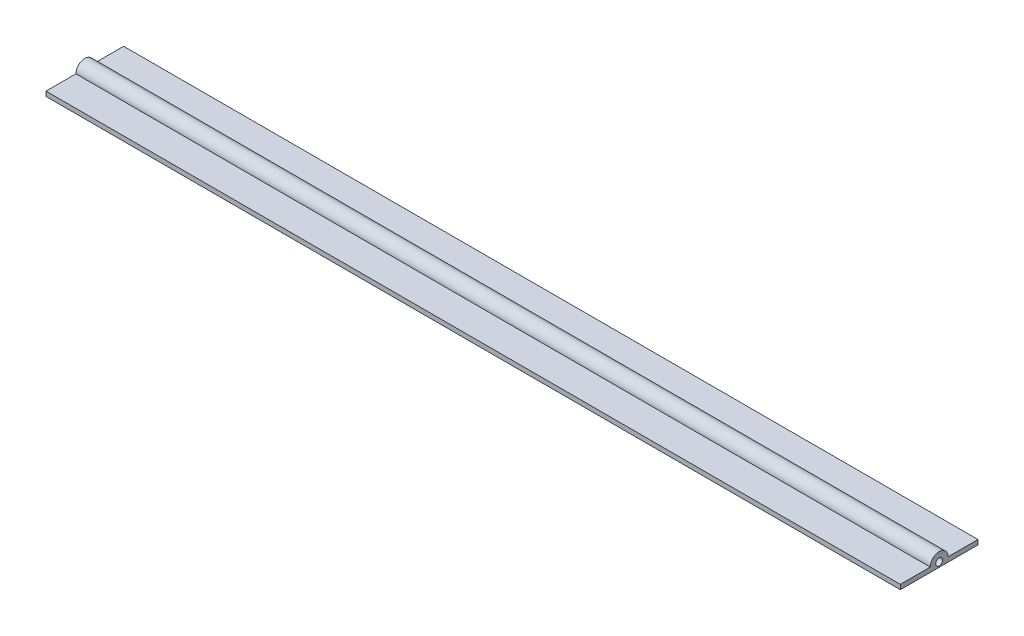
ISO-10303-21;
HEADER;
FILE_DESCRIPTION(('STEP AP214'),'2;1');
FILE_NAME('part.step','',(''),(''),'','','');
FILE_SCHEMA(('AUTOMOTIVE_DESIGN { 1 0 10303 214 1 1 1 1 }'));
ENDSEC;
DATA;
#1=APPLICATION_CONTEXT('core data for automotive mechanical design processes');
#2=APPLICATION_PROTOCOL_DEFINITION('international standard','automotive_design',2000,#1);
#3=PRODUCT_CONTEXT('',#1,'mechanical');
#4=PRODUCT('Part','Part','',(#3));
#5=PRODUCT_RELATED_PRODUCT_CATEGORY('part','',(#4));
#6=PRODUCT_DEFINITION_FORMATION('','',#4);
#7=PRODUCT_DEFINITION_CONTEXT('part definition',#1,'design');
#8=PRODUCT_DEFINITION('design','',#6,#7);
#9=PRODUCT_DEFINITION_SHAPE('','',#8);
#10=(LENGTH_UNIT() NAMED_UNIT(*) SI_UNIT(.MILLI.,.METRE.));
#11=(NAMED_UNIT(*) PLANE_ANGLE_UNIT() SI_UNIT($,.RADIAN.));
#12=(NAMED_UNIT(*) SI_UNIT($,.STERADIAN.) SOLID_ANGLE_UNIT());
#13=UNCERTAINTY_MEASURE_WITH_UNIT(LENGTH_MEASURE(1.E-05),#10,'distance_accuracy_value','');
#14=(GEOMETRIC_REPRESENTATION_CONTEXT(3) GLOBAL_UNCERTAINTY_ASSIGNED_CONTEXT((#13)) GLOBAL_UNIT_ASSIGNED_CONTEXT((#10,
#11,#12)) REPRESENTATION_CONTEXT('',''));
#15=CARTESIAN_POINT('',(0.,0.,0.));
#16=DIRECTION('',(0.,0.,1.));
#17=DIRECTION('',(1.,0.,0.));
#18=AXIS2_PLACEMENT_3D('',#15,#16,#17);
#19=CARTESIAN_POINT('',(279.4,0.,0.));
#20=DIRECTION('',(0.,0.,-1.));
#21=DIRECTION('',(-1.,0.,0.));
#22=AXIS2_PLACEMENT_3D('',#19,#20,#21);
#23=PLANE('',#22);
#24=DIRECTION('',(0.,-1.,0.));
#25=VECTOR('',#24,1.);
#26=CARTESIAN_POINT('',(0.,0.,0.));
#27=LINE('',#26,#25);
#28=CARTESIAN_POINT('',(0.,1.524,0.));
#29=VERTEX_POINT('',#28);
#30=CARTESIAN_POINT('',(0.,0.,0.));
#31=VERTEX_POINT('',#30);
#32=EDGE_CURVE('E117',#29,#31,#27,.T.);
#33=ORIENTED_EDGE('',*,*,#32,.T.);
#34=DIRECTION('',(-1.,0.,0.));
#35=VECTOR('',#34,1.);
#36=CARTESIAN_POINT('',(279.4,0.,0.));
#37=LINE('',#36,#35);
#38=CARTESIAN_POINT('',(279.4,0.,0.));
#39=VERTEX_POINT('',#38);
#40=EDGE_CURVE('E11',#39,#31,#37,.T.);
#41=ORIENTED_EDGE('',*,*,#40,.F.);
#42=DIRECTION('',(0.,-1.,0.));
#43=VECTOR('',#42,1.);
#44=CARTESIAN_POINT('',(279.4,0.,0.));
#45=LINE('',#44,#43);
#46=CARTESIAN_POINT('',(279.4,1.524,0.));
#47=VERTEX_POINT('',#46);
#48=EDGE_CURVE('E128',#47,#39,#45,.T.);
#49=ORIENTED_EDGE('',*,*,#48,.F.);
#50=DIRECTION('',(-1.,0.,0.));
#51=VECTOR('',#50,1.);
#52=CARTESIAN_POINT('',(279.4,1.524,0.));
#53=LINE('',#52,#51);
#54=EDGE_CURVE('E113',#47,#29,#53,.T.);
#55=ORIENTED_EDGE('',*,*,#54,.T.);
#56=EDGE_LOOP('',(#33,#41,#49,#55));
#57=FACE_BOUND('',#56,.T.);
#58=ADVANCED_FACE('F33',(#57),#23,.F.);
#59=CARTESIAN_POINT('',(279.4,0.,0.));
#60=DIRECTION('',(0.,1.,0.));
#61=DIRECTION('',(0.,0.,1.));
#62=AXIS2_PLACEMENT_3D('',#59,#60,#61);
#63=PLANE('',#62);
#64=DIRECTION('',(0.,0.,-1.));
#65=VECTOR('',#64,1.);
#66=CARTESIAN_POINT('',(0.,0.,0.));
#67=LINE('',#66,#65);
#68=CARTESIAN_POINT('',(0.,0.,-25.4));
#69=VERTEX_POINT('',#68);
#70=EDGE_CURVE('E120',#31,#69,#67,.T.);
#71=ORIENTED_EDGE('',*,*,#70,.T.);
#72=DIRECTION('',(-1.,0.,0.));
#73=VECTOR('',#72,1.);
#74=CARTESIAN_POINT('',(279.4,0.,-25.4));
#75=LINE('',#74,#73);
#76=CARTESIAN_POINT('',(279.4,0.,-25.4));
#77=VERTEX_POINT('',#76);
#78=EDGE_CURVE('E41',#77,#69,#75,.T.);
#79=ORIENTED_EDGE('',*,*,#78,.F.);
#80=DIRECTION('',(0.,0.,-1.));
#81=VECTOR('',#80,1.);
#82=CARTESIAN_POINT('',(279.4,0.,0.));
#83=LINE('',#82,#81);
#84=EDGE_CURVE('E86',#39,#77,#83,.T.);
#85=ORIENTED_EDGE('',*,*,#84,.F.);
#86=ORIENTED_EDGE('',*,*,#40,.T.);
#87=EDGE_LOOP('',(#71,#79,#85,#86));
#88=FACE_BOUND('',#87,.T.);
#89=ADVANCED_FACE('F153',(#88),#63,.F.);
#90=CARTESIAN_POINT('',(279.4,0.,-25.4));
#91=DIRECTION('',(0.,0.,1.));
#92=DIRECTION('',(1.,0.,0.));
#93=AXIS2_PLACEMENT_3D('',#90,#91,#92);
#94=PLANE('',#93);
#95=DIRECTION('',(0.,1.,0.));
#96=VECTOR('',#95,1.);
#97=CARTESIAN_POINT('',(0.,0.,-25.4));
#98=LINE('',#97,#96);
#99=CARTESIAN_POINT('',(0.,1.524,-25.4));
#100=VERTEX_POINT('',#99);
#101=EDGE_CURVE('E123',#69,#100,#98,.T.);
#102=ORIENTED_EDGE('',*,*,#101,.T.);
#103=DIRECTION('',(-1.,0.,0.));
#104=VECTOR('',#103,1.);
#105=CARTESIAN_POINT('',(279.4,1.524,-25.4));
#106=LINE('',#105,#104);
#107=CARTESIAN_POINT('',(279.4,1.524,-25.4));
#108=VERTEX_POINT('',#107);
#109=EDGE_CURVE('E108',#108,#100,#106,.T.);
#110=ORIENTED_EDGE('',*,*,#109,.F.);
#111=DIRECTION('',(0.,1.,0.));
#112=VECTOR('',#111,1.);
#113=CARTESIAN_POINT('',(279.4,0.,-25.4));
#114=LINE('',#113,#112);
#115=EDGE_CURVE('E99',#77,#108,#114,.T.);
#116=ORIENTED_EDGE('',*,*,#115,.F.);
#117=ORIENTED_EDGE('',*,*,#78,.T.);
#118=EDGE_LOOP('',(#102,#110,#116,#117));
#119=FACE_BOUND('',#118,.T.);
#120=ADVANCED_FACE('F134',(#119),#94,.F.);
#121=CARTESIAN_POINT('',(279.4,1.524,-15.6124220905501));
#122=DIRECTION('',(0.,-1.,0.));
#123=DIRECTION('',(0.,0.,-1.));
#124=AXIS2_PLACEMENT_3D('',#121,#122,#123);
#125=PLANE('',#124);
#126=DIRECTION('',(0.,0.,1.));
#127=VECTOR('',#126,1.);
#128=CARTESIAN_POINT('',(0.,1.524,-15.6124220905501));
#129=LINE('',#128,#127);
#130=CARTESIAN_POINT('',(0.,1.524,-15.6124220905501));
#131=VERTEX_POINT('',#130);
#132=EDGE_CURVE('E107',#100,#131,#129,.T.);
#133=ORIENTED_EDGE('',*,*,#132,.T.);
#134=DIRECTION('',(-1.,0.,0.));
#135=VECTOR('',#134,1.);
#136=CARTESIAN_POINT('',(279.4,1.524,-15.6124220905501));
#137=LINE('',#136,#135);
#138=CARTESIAN_POINT('',(279.4,1.524,-15.6124220905501));
#139=VERTEX_POINT('',#138);
#140=EDGE_CURVE('E104',#139,#131,#137,.T.);
#141=ORIENTED_EDGE('',*,*,#140,.F.);
#142=DIRECTION('',(0.,0.,1.));
#143=VECTOR('',#142,1.);
#144=CARTESIAN_POINT('',(279.4,1.524,-15.6124220905501));
#145=LINE('',#144,#143);
#146=EDGE_CURVE('E93',#108,#139,#145,.T.);
#147=ORIENTED_EDGE('',*,*,#146,.F.);
#148=ORIENTED_EDGE('',*,*,#109,.T.);
#149=EDGE_LOOP('',(#133,#141,#147,#148));
#150=FACE_BOUND('',#149,.T.);
#151=ADVANCED_FACE('F105',(#150),#125,.F.);
#152=CARTESIAN_POINT('',(279.4,1.524,-12.7));
#153=DIRECTION('',(-1.,0.,0.));
#154=DIRECTION('',(0.,0.,1.));
#155=AXIS2_PLACEMENT_3D('',#152,#153,#154);
#156=CYLINDRICAL_SURFACE('',#155,2.91242209055014);
#157=CARTESIAN_POINT('',(0.,1.524,-12.7));
#158=DIRECTION('',(1.,0.,0.));
#159=DIRECTION('',(0.,0.,-1.));
#160=AXIS2_PLACEMENT_3D('',#157,#158,#159);
#161=CIRCLE('',#160,2.91242209055014);
#162=CARTESIAN_POINT('',(0.,1.524,-9.78757790944986));
#163=VERTEX_POINT('',#162);
#164=EDGE_CURVE('E72',#131,#163,#161,.T.);
#165=ORIENTED_EDGE('',*,*,#164,.T.);
#166=DIRECTION('',(-1.,0.,0.));
#167=VECTOR('',#166,1.);
#168=CARTESIAN_POINT('',(279.4,1.524,-9.78757790944986));
#169=LINE('',#168,#167);
#170=CARTESIAN_POINT('',(279.4,1.524,-9.78757790944986));
#171=VERTEX_POINT('',#170);
#172=EDGE_CURVE('E109',#171,#163,#169,.T.);
#173=ORIENTED_EDGE('',*,*,#172,.F.);
#174=CARTESIAN_POINT('',(279.4,1.524,-12.7));
#175=DIRECTION('',(1.,0.,0.));
#176=DIRECTION('',(0.,0.,-1.));
#177=AXIS2_PLACEMENT_3D('',#174,#175,#176);
#178=CIRCLE('',#177,2.91242209055014);
#179=EDGE_CURVE('E97',#139,#171,#178,.T.);
#180=ORIENTED_EDGE('',*,*,#179,.F.);
#181=ORIENTED_EDGE('',*,*,#140,.T.);
#182=EDGE_LOOP('',(#165,#173,#180,#181));
#183=FACE_BOUND('',#182,.T.);
#184=ADVANCED_FACE('F111',(#183),#156,.T.);
#185=CARTESIAN_POINT('',(279.4,1.524,0.));
#186=DIRECTION('',(0.,-1.,0.));
#187=DIRECTION('',(0.,0.,-1.));
#188=AXIS2_PLACEMENT_3D('',#185,#186,#187);
#189=PLANE('',#188);
#190=DIRECTION('',(0.,0.,1.));
#191=VECTOR('',#190,1.);
#192=CARTESIAN_POINT('',(0.,1.524,0.));
#193=LINE('',#192,#191);
#194=EDGE_CURVE('E78',#163,#29,#193,.T.);
#195=ORIENTED_EDGE('',*,*,#194,.T.);
#196=ORIENTED_EDGE('',*,*,#54,.F.);
#197=DIRECTION('',(0.,0.,1.));
#198=VECTOR('',#197,1.);
#199=CARTESIAN_POINT('',(279.4,1.524,0.));
#200=LINE('',#199,#198);
#201=EDGE_CURVE('E49',#171,#47,#200,.T.);
#202=ORIENTED_EDGE('',*,*,#201,.F.);
#203=ORIENTED_EDGE('',*,*,#172,.T.);
#204=EDGE_LOOP('',(#195,#196,#202,#203));
#205=FACE_BOUND('',#204,.T.);
#206=ADVANCED_FACE('F141',(#205),#189,.F.);
#207=CARTESIAN_POINT('',(279.4,1.524,-12.7));
#208=DIRECTION('',(1.,0.,0.));
#209=DIRECTION('',(0.,0.,-1.));
#210=AXIS2_PLACEMENT_3D('',#207,#208,#209);
#211=PLANE('',#210);
#212=CARTESIAN_POINT('',(279.4,1.524,-12.7));
#213=DIRECTION('',(1.,0.,0.));
#214=DIRECTION('',(0.,0.,-1.));
#215=AXIS2_PLACEMENT_3D('',#212,#213,#214);
#216=CIRCLE('',#215,1.12561349299947);
#217=CARTESIAN_POINT('',(279.4,1.524,-13.8256134929995));
#218=VERTEX_POINT('',#217);
#219=EDGE_CURVE('E206',#218,#218,#216,.T.);
#220=ORIENTED_EDGE('',*,*,#219,.F.);
#221=EDGE_LOOP('',(#220));
#222=FACE_BOUND('',#221,.T.);
#223=ORIENTED_EDGE('',*,*,#48,.T.);
#224=ORIENTED_EDGE('',*,*,#84,.T.);
#225=ORIENTED_EDGE('',*,*,#115,.T.);
#226=ORIENTED_EDGE('',*,*,#146,.T.);
#227=ORIENTED_EDGE('',*,*,#179,.T.);
#228=ORIENTED_EDGE('',*,*,#201,.T.);
#229=EDGE_LOOP('',(#223,#224,#225,#226,#227,#228));
#230=FACE_BOUND('',#229,.T.);
#231=ADVANCED_FACE('F95',(#222,#230),#211,.T.);
#232=CARTESIAN_POINT('',(0.,1.524,-12.7));
#233=DIRECTION('',(1.,0.,0.));
#234=DIRECTION('',(0.,0.,-1.));
#235=AXIS2_PLACEMENT_3D('',#232,#233,#234);
#236=PLANE('',#235);
#237=CARTESIAN_POINT('',(0.,1.524,-12.7));
#238=DIRECTION('',(1.,0.,0.));
#239=DIRECTION('',(0.,0.,-1.));
#240=AXIS2_PLACEMENT_3D('',#237,#238,#239);
#241=CIRCLE('',#240,1.12561349299947);
#242=CARTESIAN_POINT('',(0.,1.524,-13.8256134929995));
#243=VERTEX_POINT('',#242);
#244=EDGE_CURVE('E121',#243,#243,#241,.F.);
#245=ORIENTED_EDGE('',*,*,#244,.F.);
#246=EDGE_LOOP('',(#245));
#247=FACE_BOUND('',#246,.T.);
#248=ORIENTED_EDGE('',*,*,#32,.F.);
#249=ORIENTED_EDGE('',*,*,#194,.F.);
#250=ORIENTED_EDGE('',*,*,#164,.F.);
#251=ORIENTED_EDGE('',*,*,#132,.F.);
#252=ORIENTED_EDGE('',*,*,#101,.F.);
#253=ORIENTED_EDGE('',*,*,#70,.F.);
#254=EDGE_LOOP('',(#248,#249,#250,#251,#252,#253));
#255=FACE_BOUND('',#254,.T.);
#256=ADVANCED_FACE('F137',(#247,#255),#236,.F.);
#257=CARTESIAN_POINT('',(-0.000999999999973245,1.524,-12.7));
#258=DIRECTION('',(1.,0.,0.));
#259=DIRECTION('',(0.,0.,-1.));
#260=AXIS2_PLACEMENT_3D('',#257,#258,#259);
#261=CYLINDRICAL_SURFACE('',#260,1.12561349299947);
#262=ORIENTED_EDGE('',*,*,#219,.T.);
#263=EDGE_LOOP('',(#262));
#264=FACE_BOUND('',#263,.T.);
#265=ORIENTED_EDGE('',*,*,#244,.T.);
#266=EDGE_LOOP('',(#265));
#267=FACE_BOUND('',#266,.T.);
#268=ADVANCED_FACE('F190',(#264,#267),#261,.F.);
#269=CLOSED_SHELL('',(#58,#89,#120,#151,#184,#206,#231,#256,#268));
#270=MANIFOLD_SOLID_BREP('B2',#269);
#271=ADVANCED_BREP_SHAPE_REPRESENTATION('',(#18,#270),#14);
#272=SHAPE_DEFINITION_REPRESENTATION(#9,#271);
ENDSEC;
END-ISO-10303-21;
